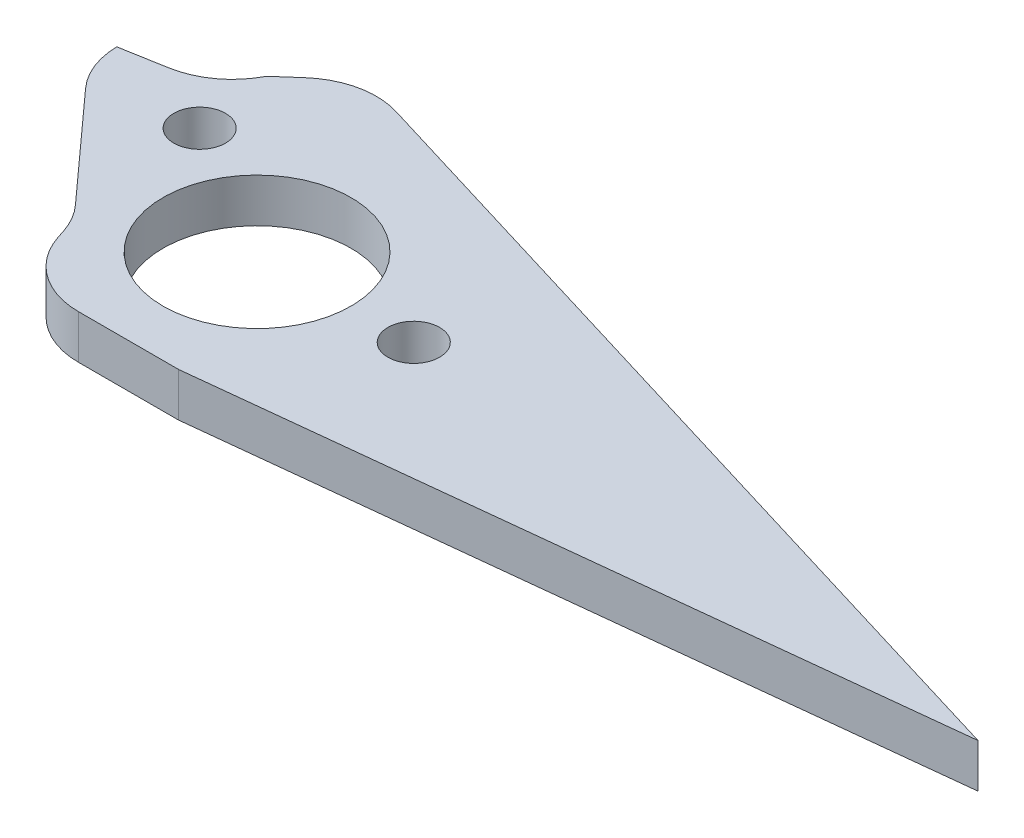
ISO-10303-21;
HEADER;
FILE_DESCRIPTION(('STEP AP214'),'2;1');
FILE_NAME('part.step','',(''),(''),'','','');
FILE_SCHEMA(('AUTOMOTIVE_DESIGN { 1 0 10303 214 1 1 1 1 }'));
ENDSEC;
DATA;
#1=APPLICATION_CONTEXT('core data for automotive mechanical design processes');
#2=APPLICATION_PROTOCOL_DEFINITION('international standard','automotive_design',2000,#1);
#3=PRODUCT_CONTEXT('',#1,'mechanical');
#4=PRODUCT('Part','Part','',(#3));
#5=PRODUCT_RELATED_PRODUCT_CATEGORY('part','',(#4));
#6=PRODUCT_DEFINITION_FORMATION('','',#4);
#7=PRODUCT_DEFINITION_CONTEXT('part definition',#1,'design');
#8=PRODUCT_DEFINITION('design','',#6,#7);
#9=PRODUCT_DEFINITION_SHAPE('','',#8);
#10=(LENGTH_UNIT() NAMED_UNIT(*) SI_UNIT(.MILLI.,.METRE.));
#11=(NAMED_UNIT(*) PLANE_ANGLE_UNIT() SI_UNIT($,.RADIAN.));
#12=(NAMED_UNIT(*) SI_UNIT($,.STERADIAN.) SOLID_ANGLE_UNIT());
#13=UNCERTAINTY_MEASURE_WITH_UNIT(LENGTH_MEASURE(1.E-05),#10,'distance_accuracy_value','');
#14=(GEOMETRIC_REPRESENTATION_CONTEXT(3) GLOBAL_UNCERTAINTY_ASSIGNED_CONTEXT((#13)) GLOBAL_UNIT_ASSIGNED_CONTEXT((#10,
#11,#12)) REPRESENTATION_CONTEXT('',''));
#15=CARTESIAN_POINT('',(0.,0.,0.));
#16=DIRECTION('',(0.,0.,1.));
#17=DIRECTION('',(1.,0.,0.));
#18=AXIS2_PLACEMENT_3D('',#15,#16,#17);
#19=CARTESIAN_POINT('',(0.,2.8,0.));
#20=DIRECTION('',(0.,-1.,0.));
#21=DIRECTION('',(0.,0.,-1.));
#22=AXIS2_PLACEMENT_3D('',#19,#20,#21);
#23=PLANE('',#22);
#24=CARTESIAN_POINT('',(10.,2.8,0.));
#25=DIRECTION('',(0.,-1.,0.));
#26=DIRECTION('',(0.,0.,-1.));
#27=AXIS2_PLACEMENT_3D('',#24,#25,#26);
#28=CIRCLE('',#27,1.65);
#29=CARTESIAN_POINT('',(10.,2.8,-1.65));
#30=VERTEX_POINT('',#29);
#31=EDGE_CURVE('E293',#30,#30,#28,.T.);
#32=ORIENTED_EDGE('',*,*,#31,.T.);
#33=EDGE_LOOP('',(#32));
#34=FACE_BOUND('',#33,.T.);
#35=CARTESIAN_POINT('',(-8.66025403784442,2.8,-4.99999999999995));
#36=DIRECTION('',(0.,-1.,0.));
#37=DIRECTION('',(0.,0.,-1.));
#38=AXIS2_PLACEMENT_3D('',#35,#36,#37);
#39=CIRCLE('',#38,1.65);
#40=CARTESIAN_POINT('',(-8.66025403784442,2.8,-6.64999999999995));
#41=VERTEX_POINT('',#40);
#42=EDGE_CURVE('E297',#41,#41,#39,.T.);
#43=ORIENTED_EDGE('',*,*,#42,.T.);
#44=EDGE_LOOP('',(#43));
#45=FACE_BOUND('',#44,.T.);
#46=DIRECTION('',(-0.749837855365093,0.,0.661621637086846));
#47=VECTOR('',#46,1.);
#48=CARTESIAN_POINT('',(-9.40000000000001,2.8,-10.));
#49=LINE('',#48,#47);
#50=CARTESIAN_POINT('',(-8.09150800363906,2.8,-11.154551761495));
#51=VERTEX_POINT('',#50);
#52=CARTESIAN_POINT('',(-9.40000000000001,2.8,-10.));
#53=VERTEX_POINT('',#52);
#54=EDGE_CURVE('E154',#51,#53,#49,.T.);
#55=ORIENTED_EDGE('',*,*,#54,.T.);
#56=CARTESIAN_POINT('',(-13.8527872947933,2.8,-12.2743538219299));
#57=DIRECTION('',(0.,-1.,0.));
#58=DIRECTION('',(0.,0.,-1.));
#59=AXIS2_PLACEMENT_3D('',#56,#57,#58);
#60=CIRCLE('',#59,5.);
#61=CARTESIAN_POINT('',(-12.9845464064586,2.8,-7.3503150568689));
#62=VERTEX_POINT('',#61);
#63=EDGE_CURVE('E47',#53,#62,#60,.T.);
#64=ORIENTED_EDGE('',*,*,#63,.T.);
#65=DIRECTION('',(0.984807753012207,0.,-0.173648177666937));
#66=VECTOR('',#65,1.);
#67=CARTESIAN_POINT('',(-15.8,2.8,-6.85387462539493));
#68=LINE('',#67,#66);
#69=CARTESIAN_POINT('',(-15.7994874195006,2.8,-6.85396500716676));
#70=VERTEX_POINT('',#69);
#71=EDGE_CURVE('E217',#62,#70,#68,.F.);
#72=ORIENTED_EDGE('',*,*,#71,.T.);
#73=CARTESIAN_POINT('',(-10.8,2.8,-6.92555789965802));
#74=DIRECTION('',(0.,-1.,0.));
#75=DIRECTION('',(0.,0.,-1.));
#76=AXIS2_PLACEMENT_3D('',#73,#74,#75);
#77=CIRCLE('',#76,5.);
#78=CARTESIAN_POINT('',(-14.5084427636084,2.8,-3.57183574822084));
#79=VERTEX_POINT('',#78);
#80=EDGE_CURVE('E192',#70,#79,#77,.F.);
#81=ORIENTED_EDGE('',*,*,#80,.T.);
#82=DIRECTION('',(0.670744430287435,0.,0.741688552721683));
#83=VECTOR('',#82,1.);
#84=CARTESIAN_POINT('',(-15.8,2.8,-5.));
#85=LINE('',#84,#83);
#86=CARTESIAN_POINT('',(-8.36606331189526,2.8,3.22021845319274));
#87=VERTEX_POINT('',#86);
#88=EDGE_CURVE('E176',#79,#87,#85,.T.);
#89=ORIENTED_EDGE('',*,*,#88,.T.);
#90=CARTESIAN_POINT('',(-12.0745060755037,2.8,6.57394060462992));
#91=DIRECTION('',(0.,-1.,0.));
#92=DIRECTION('',(0.,0.,-1.));
#93=AXIS2_PLACEMENT_3D('',#90,#91,#92);
#94=CIRCLE('',#93,5.);
#95=CARTESIAN_POINT('',(-7.32944171230372,2.8,4.99775400746263));
#96=VERTEX_POINT('',#95);
#97=EDGE_CURVE('E210',#87,#96,#94,.T.);
#98=ORIENTED_EDGE('',*,*,#97,.T.);
#99=DIRECTION('',(0.315237319433459,0.,0.949012872639991));
#100=VECTOR('',#99,1.);
#101=CARTESIAN_POINT('',(-7.6608695652174,2.8,4.));
#102=LINE('',#101,#100);
#103=CARTESIAN_POINT('',(-7.13730149554965,2.8,5.5761865971673));
#104=VERTEX_POINT('',#103);
#105=EDGE_CURVE('E137',#96,#104,#102,.T.);
#106=ORIENTED_EDGE('',*,*,#105,.T.);
#107=CARTESIAN_POINT('',(-2.3922371323497,2.8,4.));
#108=DIRECTION('',(0.,-1.,0.));
#109=DIRECTION('',(0.,0.,-1.));
#110=AXIS2_PLACEMENT_3D('',#107,#108,#109);
#111=CIRCLE('',#110,5.);
#112=CARTESIAN_POINT('',(-2.3922371323497,2.8,9.));
#113=VERTEX_POINT('',#112);
#114=EDGE_CURVE('E133',#104,#113,#111,.F.);
#115=ORIENTED_EDGE('',*,*,#114,.T.);
#116=DIRECTION('',(1.,0.,0.));
#117=VECTOR('',#116,1.);
#118=CARTESIAN_POINT('',(4.,2.8,9.));
#119=LINE('',#118,#117);
#120=CARTESIAN_POINT('',(4.,2.8,9.));
#121=VERTEX_POINT('',#120);
#122=EDGE_CURVE('E124',#113,#121,#119,.T.);
#123=ORIENTED_EDGE('',*,*,#122,.T.);
#124=DIRECTION('',(0.994144463069457,0.,-0.108059180768419));
#125=VECTOR('',#124,1.);
#126=CARTESIAN_POINT('',(50.,2.8,3.99999999999999));
#127=LINE('',#126,#125);
#128=CARTESIAN_POINT('',(50.,2.8,3.99999999999999));
#129=VERTEX_POINT('',#128);
#130=EDGE_CURVE('E129',#121,#129,#127,.T.);
#131=ORIENTED_EDGE('',*,*,#130,.T.);
#132=DIRECTION('',(-0.956880576642772,0.,-0.290481603623699));
#133=VECTOR('',#132,1.);
#134=CARTESIAN_POINT('',(-6.,2.8,-13.));
#135=LINE('',#134,#133);
#136=CARTESIAN_POINT('',(-3.33099180008633,2.8,-12.1897653678834));
#137=VERTEX_POINT('',#136);
#138=EDGE_CURVE('E152',#129,#137,#135,.T.);
#139=ORIENTED_EDGE('',*,*,#138,.T.);
#140=CARTESIAN_POINT('',(-4.78339981820483,2.8,-7.40536248466949));
#141=DIRECTION('',(0.,-1.,0.));
#142=DIRECTION('',(0.,0.,-1.));
#143=AXIS2_PLACEMENT_3D('',#140,#141,#142);
#144=CIRCLE('',#143,5.);
#145=EDGE_CURVE('E194',#137,#51,#144,.F.);
#146=ORIENTED_EDGE('',*,*,#145,.T.);
#147=EDGE_LOOP('',(#55,#64,#72,#81,#89,#98,#106,#115,#123,#131,#139,#146));
#148=FACE_BOUND('',#147,.T.);
#149=CARTESIAN_POINT('',(0.,2.8,0.));
#150=DIRECTION('',(0.,1.,0.));
#151=DIRECTION('',(0.,0.,1.));
#152=AXIS2_PLACEMENT_3D('',#149,#150,#151);
#153=CIRCLE('',#152,6.);
#154=CARTESIAN_POINT('',(0.,2.8,6.));
#155=VERTEX_POINT('',#154);
#156=EDGE_CURVE('E164',#155,#155,#153,.T.);
#157=ORIENTED_EDGE('',*,*,#156,.F.);
#158=EDGE_LOOP('',(#157));
#159=FACE_BOUND('',#158,.T.);
#160=ADVANCED_FACE('F39',(#34,#45,#148,#159),#23,.F.);
#161=CARTESIAN_POINT('',(0.,0.,0.));
#162=DIRECTION('',(0.,-1.,0.));
#163=DIRECTION('',(0.,0.,-1.));
#164=AXIS2_PLACEMENT_3D('',#161,#162,#163);
#165=PLANE('',#164);
#166=CARTESIAN_POINT('',(10.,0.,0.));
#167=DIRECTION('',(0.,-1.,0.));
#168=DIRECTION('',(0.,0.,-1.));
#169=AXIS2_PLACEMENT_3D('',#166,#167,#168);
#170=CIRCLE('',#169,1.65);
#171=CARTESIAN_POINT('',(10.,0.,-1.65));
#172=VERTEX_POINT('',#171);
#173=EDGE_CURVE('E300',#172,#172,#170,.T.);
#174=ORIENTED_EDGE('',*,*,#173,.F.);
#175=EDGE_LOOP('',(#174));
#176=FACE_BOUND('',#175,.T.);
#177=CARTESIAN_POINT('',(-8.66025403784442,0.,-4.99999999999995));
#178=DIRECTION('',(0.,-1.,0.));
#179=DIRECTION('',(0.,0.,-1.));
#180=AXIS2_PLACEMENT_3D('',#177,#178,#179);
#181=CIRCLE('',#180,1.65);
#182=CARTESIAN_POINT('',(-8.66025403784442,0.,-6.64999999999995));
#183=VERTEX_POINT('',#182);
#184=EDGE_CURVE('E301',#183,#183,#181,.T.);
#185=ORIENTED_EDGE('',*,*,#184,.F.);
#186=EDGE_LOOP('',(#185));
#187=FACE_BOUND('',#186,.T.);
#188=DIRECTION('',(-0.984807753012207,0.,0.173648177666937));
#189=VECTOR('',#188,1.);
#190=CARTESIAN_POINT('',(-1.64850988664828,0.,-9.34916414960804));
#191=LINE('',#190,#189);
#192=CARTESIAN_POINT('',(-15.7994874195006,0.,-6.85396500716676));
#193=VERTEX_POINT('',#192);
#194=CARTESIAN_POINT('',(-12.9845464064586,0.,-7.3503150568689));
#195=VERTEX_POINT('',#194);
#196=EDGE_CURVE('E212',#193,#195,#191,.F.);
#197=ORIENTED_EDGE('',*,*,#196,.T.);
#198=CARTESIAN_POINT('',(-13.8527872947933,0.,-12.2743538219299));
#199=DIRECTION('',(0.,-1.,0.));
#200=DIRECTION('',(0.,0.,-1.));
#201=AXIS2_PLACEMENT_3D('',#198,#199,#200);
#202=CIRCLE('',#201,5.);
#203=CARTESIAN_POINT('',(-9.40000000000001,0.,-10.));
#204=VERTEX_POINT('',#203);
#205=EDGE_CURVE('E11',#195,#204,#202,.F.);
#206=ORIENTED_EDGE('',*,*,#205,.T.);
#207=DIRECTION('',(-0.749837855365093,0.,0.661621637086846));
#208=VECTOR('',#207,1.);
#209=CARTESIAN_POINT('',(-9.40000000000001,0.,-10.));
#210=LINE('',#209,#208);
#211=CARTESIAN_POINT('',(-8.09150800363906,0.,-11.154551761495));
#212=VERTEX_POINT('',#211);
#213=EDGE_CURVE('E173',#212,#204,#210,.T.);
#214=ORIENTED_EDGE('',*,*,#213,.F.);
#215=CARTESIAN_POINT('',(-4.78339981820483,0.,-7.40536248466949));
#216=DIRECTION('',(0.,-1.,0.));
#217=DIRECTION('',(0.,0.,-1.));
#218=AXIS2_PLACEMENT_3D('',#215,#216,#217);
#219=CIRCLE('',#218,5.);
#220=CARTESIAN_POINT('',(-3.33099180008633,0.,-12.1897653678834));
#221=VERTEX_POINT('',#220);
#222=EDGE_CURVE('E187',#212,#221,#219,.T.);
#223=ORIENTED_EDGE('',*,*,#222,.T.);
#224=DIRECTION('',(-0.956880576642772,0.,-0.290481603623699));
#225=VECTOR('',#224,1.);
#226=CARTESIAN_POINT('',(-6.,0.,-13.));
#227=LINE('',#226,#225);
#228=CARTESIAN_POINT('',(50.,0.,3.99999999999999));
#229=VERTEX_POINT('',#228);
#230=EDGE_CURVE('E170',#229,#221,#227,.T.);
#231=ORIENTED_EDGE('',*,*,#230,.F.);
#232=DIRECTION('',(0.994144463069457,0.,-0.108059180768419));
#233=VECTOR('',#232,1.);
#234=CARTESIAN_POINT('',(50.,0.,3.99999999999999));
#235=LINE('',#234,#233);
#236=CARTESIAN_POINT('',(4.,0.,9.));
#237=VERTEX_POINT('',#236);
#238=EDGE_CURVE('E168',#237,#229,#235,.T.);
#239=ORIENTED_EDGE('',*,*,#238,.F.);
#240=DIRECTION('',(1.,0.,0.));
#241=VECTOR('',#240,1.);
#242=CARTESIAN_POINT('',(4.,0.,9.));
#243=LINE('',#242,#241);
#244=CARTESIAN_POINT('',(-2.3922371323497,0.,9.));
#245=VERTEX_POINT('',#244);
#246=EDGE_CURVE('E143',#245,#237,#243,.T.);
#247=ORIENTED_EDGE('',*,*,#246,.F.);
#248=CARTESIAN_POINT('',(-2.3922371323497,0.,4.));
#249=DIRECTION('',(0.,-1.,0.));
#250=DIRECTION('',(0.,0.,-1.));
#251=AXIS2_PLACEMENT_3D('',#248,#249,#250);
#252=CIRCLE('',#251,5.);
#253=CARTESIAN_POINT('',(-7.13730149554965,0.,5.5761865971673));
#254=VERTEX_POINT('',#253);
#255=EDGE_CURVE('E182',#245,#254,#252,.T.);
#256=ORIENTED_EDGE('',*,*,#255,.T.);
#257=DIRECTION('',(0.315237319433459,0.,0.949012872639991));
#258=VECTOR('',#257,1.);
#259=CARTESIAN_POINT('',(-7.6608695652174,0.,4.));
#260=LINE('',#259,#258);
#261=CARTESIAN_POINT('',(-7.32944171230372,0.,4.99775400746263));
#262=VERTEX_POINT('',#261);
#263=EDGE_CURVE('E163',#262,#254,#260,.T.);
#264=ORIENTED_EDGE('',*,*,#263,.F.);
#265=CARTESIAN_POINT('',(-12.0745060755037,0.,6.57394060462992));
#266=DIRECTION('',(0.,-1.,0.));
#267=DIRECTION('',(0.,0.,-1.));
#268=AXIS2_PLACEMENT_3D('',#265,#266,#267);
#269=CIRCLE('',#268,5.);
#270=CARTESIAN_POINT('',(-8.36606331189526,0.,3.22021845319274));
#271=VERTEX_POINT('',#270);
#272=EDGE_CURVE('E208',#262,#271,#269,.F.);
#273=ORIENTED_EDGE('',*,*,#272,.T.);
#274=DIRECTION('',(0.670744430287435,0.,0.741688552721683));
#275=VECTOR('',#274,1.);
#276=CARTESIAN_POINT('',(-15.8,0.,-5.));
#277=LINE('',#276,#275);
#278=CARTESIAN_POINT('',(-14.5084427636084,0.,-3.57183574822084));
#279=VERTEX_POINT('',#278);
#280=EDGE_CURVE('E160',#279,#271,#277,.T.);
#281=ORIENTED_EDGE('',*,*,#280,.F.);
#282=CARTESIAN_POINT('',(-10.8,0.,-6.92555789965802));
#283=DIRECTION('',(0.,-1.,0.));
#284=DIRECTION('',(0.,0.,-1.));
#285=AXIS2_PLACEMENT_3D('',#282,#283,#284);
#286=CIRCLE('',#285,5.);
#287=EDGE_CURVE('E184',#279,#193,#286,.T.);
#288=ORIENTED_EDGE('',*,*,#287,.T.);
#289=EDGE_LOOP('',(#197,#206,#214,#223,#231,#239,#247,#256,#264,#273,#281,#288));
#290=FACE_BOUND('',#289,.T.);
#291=CARTESIAN_POINT('',(0.,0.,0.));
#292=DIRECTION('',(0.,1.,0.));
#293=DIRECTION('',(0.,0.,1.));
#294=AXIS2_PLACEMENT_3D('',#291,#292,#293);
#295=CIRCLE('',#294,6.);
#296=CARTESIAN_POINT('',(0.,0.,6.));
#297=VERTEX_POINT('',#296);
#298=EDGE_CURVE('E290',#297,#297,#295,.T.);
#299=ORIENTED_EDGE('',*,*,#298,.T.);
#300=EDGE_LOOP('',(#299));
#301=FACE_BOUND('',#300,.T.);
#302=ADVANCED_FACE('F229',(#176,#187,#290,#301),#165,.T.);
#303=CARTESIAN_POINT('',(-15.8,2.8,-5.));
#304=DIRECTION('',(0.741688552721683,0.,-0.670744430287435));
#305=DIRECTION('',(-0.670744430287435,0.,-0.741688552721683));
#306=AXIS2_PLACEMENT_3D('',#303,#304,#305);
#307=PLANE('',#306);
#308=ORIENTED_EDGE('',*,*,#88,.F.);
#309=DIRECTION('',(0.,-1.,0.));
#310=VECTOR('',#309,1.);
#311=CARTESIAN_POINT('',(-14.5084427636084,2.8,-3.57183574822084));
#312=LINE('',#311,#310);
#313=EDGE_CURVE('E198',#79,#279,#312,.T.);
#314=ORIENTED_EDGE('',*,*,#313,.T.);
#315=ORIENTED_EDGE('',*,*,#280,.T.);
#316=DIRECTION('',(0.,-1.,0.));
#317=VECTOR('',#316,1.);
#318=CARTESIAN_POINT('',(-8.36606331189526,2.8,3.22021845319275));
#319=LINE('',#318,#317);
#320=EDGE_CURVE('E196',#271,#87,#319,.F.);
#321=ORIENTED_EDGE('',*,*,#320,.T.);
#322=EDGE_LOOP('',(#308,#314,#315,#321));
#323=FACE_BOUND('',#322,.T.);
#324=ADVANCED_FACE('F264',(#323),#307,.F.);
#325=CARTESIAN_POINT('',(-7.6608695652174,2.8,4.));
#326=DIRECTION('',(0.949012872639991,0.,-0.315237319433459));
#327=DIRECTION('',(-0.315237319433459,0.,-0.949012872639991));
#328=AXIS2_PLACEMENT_3D('',#325,#326,#327);
#329=PLANE('',#328);
#330=ORIENTED_EDGE('',*,*,#105,.F.);
#331=DIRECTION('',(0.,-1.,0.));
#332=VECTOR('',#331,1.);
#333=CARTESIAN_POINT('',(-7.32944171230372,0.,4.99775400746263));
#334=LINE('',#333,#332);
#335=EDGE_CURVE('E203',#96,#262,#334,.T.);
#336=ORIENTED_EDGE('',*,*,#335,.T.);
#337=ORIENTED_EDGE('',*,*,#263,.T.);
#338=DIRECTION('',(0.,-1.,0.));
#339=VECTOR('',#338,1.);
#340=CARTESIAN_POINT('',(-7.13730149554965,2.8,5.5761865971673));
#341=LINE('',#340,#339);
#342=EDGE_CURVE('E201',#254,#104,#341,.F.);
#343=ORIENTED_EDGE('',*,*,#342,.T.);
#344=EDGE_LOOP('',(#330,#336,#337,#343));
#345=FACE_BOUND('',#344,.T.);
#346=ADVANCED_FACE('F279',(#345),#329,.F.);
#347=CARTESIAN_POINT('',(4.,2.8,9.));
#348=DIRECTION('',(0.,0.,-1.));
#349=DIRECTION('',(-1.,0.,0.));
#350=AXIS2_PLACEMENT_3D('',#347,#348,#349);
#351=PLANE('',#350);
#352=ORIENTED_EDGE('',*,*,#122,.F.);
#353=DIRECTION('',(0.,-1.,0.));
#354=VECTOR('',#353,1.);
#355=CARTESIAN_POINT('',(-2.3922371323497,2.8,9.));
#356=LINE('',#355,#354);
#357=EDGE_CURVE('E206',#113,#245,#356,.T.);
#358=ORIENTED_EDGE('',*,*,#357,.T.);
#359=ORIENTED_EDGE('',*,*,#246,.T.);
#360=DIRECTION('',(0.,-1.,0.));
#361=VECTOR('',#360,1.);
#362=CARTESIAN_POINT('',(4.,2.8,9.));
#363=LINE('',#362,#361);
#364=EDGE_CURVE('E140',#121,#237,#363,.T.);
#365=ORIENTED_EDGE('',*,*,#364,.F.);
#366=EDGE_LOOP('',(#352,#358,#359,#365));
#367=FACE_BOUND('',#366,.T.);
#368=ADVANCED_FACE('F141',(#367),#351,.F.);
#369=CARTESIAN_POINT('',(50.,2.8,3.99999999999999));
#370=DIRECTION('',(-0.108059180768419,0.,-0.994144463069456));
#371=DIRECTION('',(-0.994144463069457,0.,0.108059180768419));
#372=AXIS2_PLACEMENT_3D('',#369,#370,#371);
#373=PLANE('',#372);
#374=ORIENTED_EDGE('',*,*,#238,.T.);
#375=DIRECTION('',(0.,-1.,0.));
#376=VECTOR('',#375,1.);
#377=CARTESIAN_POINT('',(50.,2.8,3.99999999999999));
#378=LINE('',#377,#376);
#379=EDGE_CURVE('E147',#129,#229,#378,.T.);
#380=ORIENTED_EDGE('',*,*,#379,.F.);
#381=ORIENTED_EDGE('',*,*,#130,.F.);
#382=ORIENTED_EDGE('',*,*,#364,.T.);
#383=EDGE_LOOP('',(#374,#380,#381,#382));
#384=FACE_BOUND('',#383,.T.);
#385=ADVANCED_FACE('F149',(#384),#373,.F.);
#386=CARTESIAN_POINT('',(-6.,2.8,-13.));
#387=DIRECTION('',(-0.290481603623699,0.,0.956880576642772));
#388=DIRECTION('',(0.956880576642772,0.,0.290481603623699));
#389=AXIS2_PLACEMENT_3D('',#386,#387,#388);
#390=PLANE('',#389);
#391=ORIENTED_EDGE('',*,*,#230,.T.);
#392=DIRECTION('',(0.,-1.,0.));
#393=VECTOR('',#392,1.);
#394=CARTESIAN_POINT('',(-3.33099180008633,2.8,-12.1897653678834));
#395=LINE('',#394,#393);
#396=EDGE_CURVE('E189',#221,#137,#395,.F.);
#397=ORIENTED_EDGE('',*,*,#396,.T.);
#398=ORIENTED_EDGE('',*,*,#138,.F.);
#399=ORIENTED_EDGE('',*,*,#379,.T.);
#400=EDGE_LOOP('',(#391,#397,#398,#399));
#401=FACE_BOUND('',#400,.T.);
#402=ADVANCED_FACE('F243',(#401),#390,.F.);
#403=CARTESIAN_POINT('',(-9.40000000000001,2.8,-10.));
#404=DIRECTION('',(0.661621637086846,0.,0.749837855365093));
#405=DIRECTION('',(0.749837855365093,0.,-0.661621637086846));
#406=AXIS2_PLACEMENT_3D('',#403,#404,#405);
#407=PLANE('',#406);
#408=ORIENTED_EDGE('',*,*,#54,.F.);
#409=DIRECTION('',(0.,-1.,0.));
#410=VECTOR('',#409,1.);
#411=CARTESIAN_POINT('',(-8.09150800363906,2.8,-11.154551761495));
#412=LINE('',#411,#410);
#413=EDGE_CURVE('E146',#51,#212,#412,.T.);
#414=ORIENTED_EDGE('',*,*,#413,.T.);
#415=ORIENTED_EDGE('',*,*,#213,.T.);
#416=DIRECTION('',(0.,-1.,0.));
#417=VECTOR('',#416,1.);
#418=CARTESIAN_POINT('',(-9.40000000000001,2.8,-10.));
#419=LINE('',#418,#417);
#420=EDGE_CURVE('E159',#53,#204,#419,.T.);
#421=ORIENTED_EDGE('',*,*,#420,.F.);
#422=EDGE_LOOP('',(#408,#414,#415,#421));
#423=FACE_BOUND('',#422,.T.);
#424=ADVANCED_FACE('F237',(#423),#407,.F.);
#425=CARTESIAN_POINT('',(0.,2.8,0.));
#426=DIRECTION('',(0.,-1.,0.));
#427=DIRECTION('',(0.,0.,-1.));
#428=AXIS2_PLACEMENT_3D('',#425,#426,#427);
#429=CYLINDRICAL_SURFACE('',#428,6.);
#430=ORIENTED_EDGE('',*,*,#156,.T.);
#431=EDGE_LOOP('',(#430));
#432=FACE_BOUND('',#431,.T.);
#433=ORIENTED_EDGE('',*,*,#298,.F.);
#434=EDGE_LOOP('',(#433));
#435=FACE_BOUND('',#434,.T.);
#436=ADVANCED_FACE('F247',(#432,#435),#429,.F.);
#437=CARTESIAN_POINT('',(-4.78339981820483,2.8,-7.40536248466949));
#438=DIRECTION('',(0.,-1.,0.));
#439=DIRECTION('',(0.,0.,-1.));
#440=AXIS2_PLACEMENT_3D('',#437,#438,#439);
#441=CYLINDRICAL_SURFACE('',#440,5.);
#442=ORIENTED_EDGE('',*,*,#145,.F.);
#443=ORIENTED_EDGE('',*,*,#396,.F.);
#444=ORIENTED_EDGE('',*,*,#222,.F.);
#445=ORIENTED_EDGE('',*,*,#413,.F.);
#446=EDGE_LOOP('',(#442,#443,#444,#445));
#447=FACE_BOUND('',#446,.T.);
#448=ADVANCED_FACE('F245',(#447),#441,.T.);
#449=CARTESIAN_POINT('',(-10.8,2.8,-6.92555789965802));
#450=DIRECTION('',(0.,-1.,0.));
#451=DIRECTION('',(0.,0.,-1.));
#452=AXIS2_PLACEMENT_3D('',#449,#450,#451);
#453=CYLINDRICAL_SURFACE('',#452,5.);
#454=ORIENTED_EDGE('',*,*,#80,.F.);
#455=DIRECTION('',(0.,-1.,0.));
#456=VECTOR('',#455,1.);
#457=CARTESIAN_POINT('',(-15.7994874195006,1.4,-6.85396500716676));
#458=LINE('',#457,#456);
#459=EDGE_CURVE('E214',#70,#193,#458,.T.);
#460=ORIENTED_EDGE('',*,*,#459,.T.);
#461=ORIENTED_EDGE('',*,*,#287,.F.);
#462=ORIENTED_EDGE('',*,*,#313,.F.);
#463=EDGE_LOOP('',(#454,#460,#461,#462));
#464=FACE_BOUND('',#463,.T.);
#465=ADVANCED_FACE('F225',(#464),#453,.T.);
#466=CARTESIAN_POINT('',(-12.0745060755037,2.8,6.57394060462992));
#467=DIRECTION('',(0.,1.,0.));
#468=DIRECTION('',(0.,0.,1.));
#469=AXIS2_PLACEMENT_3D('',#466,#467,#468);
#470=CYLINDRICAL_SURFACE('',#469,5.);
#471=ORIENTED_EDGE('',*,*,#97,.F.);
#472=ORIENTED_EDGE('',*,*,#320,.F.);
#473=ORIENTED_EDGE('',*,*,#272,.F.);
#474=ORIENTED_EDGE('',*,*,#335,.F.);
#475=EDGE_LOOP('',(#471,#472,#473,#474));
#476=FACE_BOUND('',#475,.T.);
#477=ADVANCED_FACE('F253',(#476),#470,.F.);
#478=CARTESIAN_POINT('',(-2.3922371323497,2.8,4.));
#479=DIRECTION('',(0.,-1.,0.));
#480=DIRECTION('',(0.,0.,-1.));
#481=AXIS2_PLACEMENT_3D('',#478,#479,#480);
#482=CYLINDRICAL_SURFACE('',#481,5.);
#483=ORIENTED_EDGE('',*,*,#114,.F.);
#484=ORIENTED_EDGE('',*,*,#342,.F.);
#485=ORIENTED_EDGE('',*,*,#255,.F.);
#486=ORIENTED_EDGE('',*,*,#357,.F.);
#487=EDGE_LOOP('',(#483,#484,#485,#486));
#488=FACE_BOUND('',#487,.T.);
#489=ADVANCED_FACE('F315',(#488),#482,.T.);
#490=CARTESIAN_POINT('',(-8.66025403784442,10.,-4.99999999999995));
#491=DIRECTION('',(0.,-1.,0.));
#492=DIRECTION('',(0.,0.,-1.));
#493=AXIS2_PLACEMENT_3D('',#490,#491,#492);
#494=CYLINDRICAL_SURFACE('',#493,1.65);
#495=ORIENTED_EDGE('',*,*,#184,.T.);
#496=EDGE_LOOP('',(#495));
#497=FACE_BOUND('',#496,.T.);
#498=ORIENTED_EDGE('',*,*,#42,.F.);
#499=EDGE_LOOP('',(#498));
#500=FACE_BOUND('',#499,.T.);
#501=ADVANCED_FACE('F312',(#497,#500),#494,.F.);
#502=CARTESIAN_POINT('',(10.,10.,0.));
#503=DIRECTION('',(0.,-1.,0.));
#504=DIRECTION('',(0.,0.,-1.));
#505=AXIS2_PLACEMENT_3D('',#502,#503,#504);
#506=CYLINDRICAL_SURFACE('',#505,1.65);
#507=ORIENTED_EDGE('',*,*,#173,.T.);
#508=EDGE_LOOP('',(#507));
#509=FACE_BOUND('',#508,.T.);
#510=ORIENTED_EDGE('',*,*,#31,.F.);
#511=EDGE_LOOP('',(#510));
#512=FACE_BOUND('',#511,.T.);
#513=ADVANCED_FACE('F307',(#509,#512),#506,.F.);
#514=CARTESIAN_POINT('',(-15.8,2.8,-6.85387462539493));
#515=DIRECTION('',(0.173648177666937,0.,0.984807753012207));
#516=DIRECTION('',(0.,-1.,0.));
#517=AXIS2_PLACEMENT_3D('',#514,#515,#516);
#518=PLANE('',#517);
#519=ORIENTED_EDGE('',*,*,#71,.F.);
#520=DIRECTION('',(0.,-1.,0.));
#521=VECTOR('',#520,1.);
#522=CARTESIAN_POINT('',(-12.9845464064586,0.,-7.3503150568689));
#523=LINE('',#522,#521);
#524=EDGE_CURVE('E54',#62,#195,#523,.T.);
#525=ORIENTED_EDGE('',*,*,#524,.T.);
#526=ORIENTED_EDGE('',*,*,#196,.F.);
#527=ORIENTED_EDGE('',*,*,#459,.F.);
#528=EDGE_LOOP('',(#519,#525,#526,#527));
#529=FACE_BOUND('',#528,.T.);
#530=ADVANCED_FACE('F226',(#529),#518,.F.);
#531=CARTESIAN_POINT('',(-13.8527872947933,2.8,-12.2743538219299));
#532=DIRECTION('',(0.,-1.,0.));
#533=DIRECTION('',(0.,0.,-1.));
#534=AXIS2_PLACEMENT_3D('',#531,#532,#533);
#535=CYLINDRICAL_SURFACE('',#534,5.);
#536=ORIENTED_EDGE('',*,*,#205,.F.);
#537=ORIENTED_EDGE('',*,*,#524,.F.);
#538=ORIENTED_EDGE('',*,*,#63,.F.);
#539=ORIENTED_EDGE('',*,*,#420,.T.);
#540=EDGE_LOOP('',(#536,#537,#538,#539));
#541=FACE_BOUND('',#540,.T.);
#542=ADVANCED_FACE('F41',(#541),#535,.F.);
#543=CLOSED_SHELL('',(#160,#302,#324,#346,#368,#385,#402,#424,#436,#448,#465,#477,#489,#501,
#513,#530,#542));
#544=MANIFOLD_SOLID_BREP('B2',#543);
#545=ADVANCED_BREP_SHAPE_REPRESENTATION('',(#18,#544),#14);
#546=SHAPE_DEFINITION_REPRESENTATION(#9,#545);
ENDSEC;
END-ISO-10303-21;
